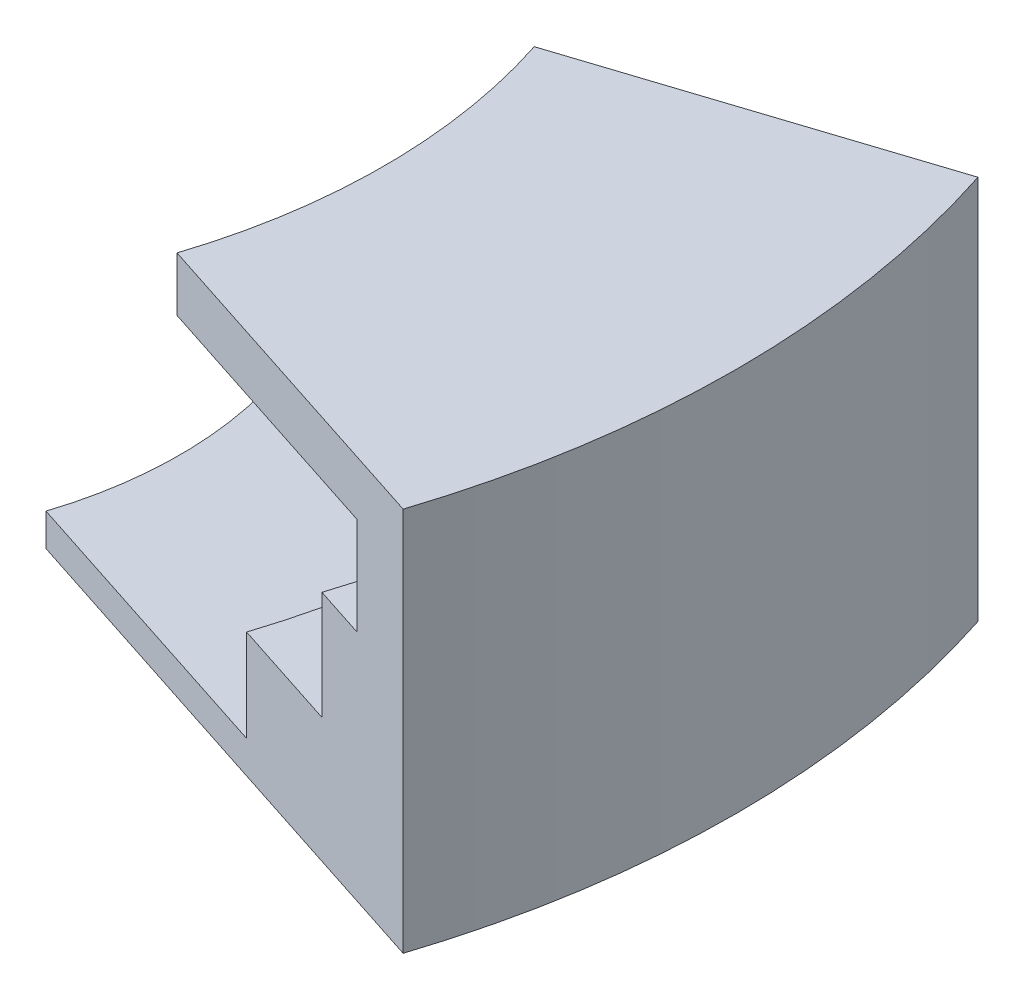
ISO-10303-21;
HEADER;
FILE_DESCRIPTION(('STEP AP214'),'2;1');
FILE_NAME('part.step','',(''),(''),'','','');
FILE_SCHEMA(('AUTOMOTIVE_DESIGN { 1 0 10303 214 1 1 1 1 }'));
ENDSEC;
DATA;
#1=APPLICATION_CONTEXT('core data for automotive mechanical design processes');
#2=APPLICATION_PROTOCOL_DEFINITION('international standard','automotive_design',2000,#1);
#3=PRODUCT_CONTEXT('',#1,'mechanical');
#4=PRODUCT('Part','Part','',(#3));
#5=PRODUCT_RELATED_PRODUCT_CATEGORY('part','',(#4));
#6=PRODUCT_DEFINITION_FORMATION('','',#4);
#7=PRODUCT_DEFINITION_CONTEXT('part definition',#1,'design');
#8=PRODUCT_DEFINITION('design','',#6,#7);
#9=PRODUCT_DEFINITION_SHAPE('','',#8);
#10=(LENGTH_UNIT() NAMED_UNIT(*) SI_UNIT(.MILLI.,.METRE.));
#11=(NAMED_UNIT(*) PLANE_ANGLE_UNIT() SI_UNIT($,.RADIAN.));
#12=(NAMED_UNIT(*) SI_UNIT($,.STERADIAN.) SOLID_ANGLE_UNIT());
#13=UNCERTAINTY_MEASURE_WITH_UNIT(LENGTH_MEASURE(1.E-05),#10,'distance_accuracy_value','');
#14=(GEOMETRIC_REPRESENTATION_CONTEXT(3) GLOBAL_UNCERTAINTY_ASSIGNED_CONTEXT((#13)) GLOBAL_UNIT_ASSIGNED_CONTEXT((#10,
#11,#12)) REPRESENTATION_CONTEXT('',''));
#15=CARTESIAN_POINT('',(0.,0.,0.));
#16=DIRECTION('',(0.,0.,1.));
#17=DIRECTION('',(1.,0.,0.));
#18=AXIS2_PLACEMENT_3D('',#15,#16,#17);
#19=CARTESIAN_POINT('',(3.54127130134828E-12,-1000.,0.));
#20=DIRECTION('',(0.,-1.,0.));
#21=DIRECTION('',(1.,0.,0.));
#22=AXIS2_PLACEMENT_3D('',#19,#20,#21);
#23=CYLINDRICAL_SURFACE('',#22,10.3500000000002);
#24=CARTESIAN_POINT('',(-2.75016451347443E-13,112.539571889782,0.));
#25=DIRECTION('',(0.,-1.,0.));
#26=DIRECTION('',(1.,0.,0.));
#27=AXIS2_PLACEMENT_3D('',#24,#25,#26);
#28=CIRCLE('',#27,10.3500000000002);
#29=CARTESIAN_POINT('',(9.84343494365476,112.539571889782,-3.19832589178074));
#30=VERTEX_POINT('',#29);
#31=CARTESIAN_POINT('',(9.84343494365474,112.539571889782,3.19832589178081));
#32=VERTEX_POINT('',#31);
#33=EDGE_CURVE('E11',#30,#32,#28,.T.);
#34=ORIENTED_EDGE('',*,*,#33,.F.);
#35=DIRECTION('',(0.,-1.,0.));
#36=VECTOR('',#35,1.);
#37=CARTESIAN_POINT('',(9.84343494365476,111.639571889782,-3.19832589178074));
#38=LINE('',#37,#36);
#39=CARTESIAN_POINT('',(9.84343494365476,111.639571889782,-3.19832589178074));
#40=VERTEX_POINT('',#39);
#41=EDGE_CURVE('E129',#30,#40,#38,.T.);
#42=ORIENTED_EDGE('',*,*,#41,.T.);
#43=CARTESIAN_POINT('',(-2.71929227248447E-13,111.639571889782,0.));
#44=DIRECTION('',(0.,-1.,0.));
#45=DIRECTION('',(1.,0.,0.));
#46=AXIS2_PLACEMENT_3D('',#43,#44,#45);
#47=CIRCLE('',#46,10.3500000000002);
#48=CARTESIAN_POINT('',(9.84343494365474,111.639571889782,3.19832589178081));
#49=VERTEX_POINT('',#48);
#50=EDGE_CURVE('E124',#40,#49,#47,.T.);
#51=ORIENTED_EDGE('',*,*,#50,.T.);
#52=DIRECTION('',(0.,-1.,0.));
#53=VECTOR('',#52,1.);
#54=CARTESIAN_POINT('',(9.84343494365474,111.639571889782,3.19832589178081));
#55=LINE('',#54,#53);
#56=EDGE_CURVE('E127',#32,#49,#55,.T.);
#57=ORIENTED_EDGE('',*,*,#56,.F.);
#58=EDGE_LOOP('',(#34,#42,#51,#57));
#59=FACE_BOUND('',#58,.T.);
#60=ADVANCED_FACE('F39',(#59),#23,.F.);
#61=CARTESIAN_POINT('',(9.84343494365476,112.539571889782,-3.19832589178074));
#62=DIRECTION('',(0.,1.,0.));
#63=DIRECTION('',(-1.,0.,0.));
#64=AXIS2_PLACEMENT_3D('',#61,#62,#63);
#65=PLANE('',#64);
#66=CARTESIAN_POINT('',(-2.75016451347443E-13,112.539571889782,0.));
#67=DIRECTION('',(0.,-1.,0.));
#68=DIRECTION('',(1.,0.,0.));
#69=AXIS2_PLACEMENT_3D('',#66,#67,#68);
#70=CIRCLE('',#69,19.0000000000002);
#71=CARTESIAN_POINT('',(18.0700738096078,112.539571889782,-5.87132289312405));
#72=VERTEX_POINT('',#71);
#73=CARTESIAN_POINT('',(18.0700738096078,112.539571889782,5.87132289312411));
#74=VERTEX_POINT('',#73);
#75=EDGE_CURVE('E48',#72,#74,#70,.T.);
#76=ORIENTED_EDGE('',*,*,#75,.F.);
#77=DIRECTION('',(-0.951056516295154,0.,0.309016994374948));
#78=VECTOR('',#77,1.);
#79=CARTESIAN_POINT('',(9.84343494365476,112.539571889782,-3.19832589178074));
#80=LINE('',#79,#78);
#81=EDGE_CURVE('E135',#72,#30,#80,.T.);
#82=ORIENTED_EDGE('',*,*,#81,.T.);
#83=ORIENTED_EDGE('',*,*,#33,.T.);
#84=DIRECTION('',(-0.951056516295154,0.,-0.309016994374948));
#85=VECTOR('',#84,1.);
#86=CARTESIAN_POINT('',(9.84343494365474,112.539571889782,3.19832589178081));
#87=LINE('',#86,#85);
#88=EDGE_CURVE('E149',#74,#32,#87,.T.);
#89=ORIENTED_EDGE('',*,*,#88,.F.);
#90=EDGE_LOOP('',(#76,#82,#83,#89));
#91=FACE_BOUND('',#90,.T.);
#92=ADVANCED_FACE('F41',(#91),#65,.T.);
#93=CARTESIAN_POINT('',(3.54127130134828E-12,-1000.,0.));
#94=DIRECTION('',(0.,-1.,0.));
#95=DIRECTION('',(1.,0.,0.));
#96=AXIS2_PLACEMENT_3D('',#93,#94,#95);
#97=CYLINDRICAL_SURFACE('',#96,19.0000000000002);
#98=CARTESIAN_POINT('',(-2.83763586294603E-13,115.089571889782,0.));
#99=DIRECTION('',(0.,-1.,0.));
#100=DIRECTION('',(1.,0.,0.));
#101=AXIS2_PLACEMENT_3D('',#98,#99,#100);
#102=CIRCLE('',#101,19.0000000000002);
#103=CARTESIAN_POINT('',(18.0700738096078,115.089571889783,-5.87132289312405));
#104=VERTEX_POINT('',#103);
#105=CARTESIAN_POINT('',(18.0700738096078,115.089571889783,5.87132289312411));
#106=VERTEX_POINT('',#105);
#107=EDGE_CURVE('E253',#104,#106,#102,.T.);
#108=ORIENTED_EDGE('',*,*,#107,.F.);
#109=DIRECTION('',(0.,-1.,0.));
#110=VECTOR('',#109,1.);
#111=CARTESIAN_POINT('',(18.0700738096078,115.089571889783,-5.87132289312405));
#112=LINE('',#111,#110);
#113=EDGE_CURVE('E225',#104,#72,#112,.T.);
#114=ORIENTED_EDGE('',*,*,#113,.T.);
#115=ORIENTED_EDGE('',*,*,#75,.T.);
#116=DIRECTION('',(0.,-1.,0.));
#117=VECTOR('',#116,1.);
#118=CARTESIAN_POINT('',(18.0700738096078,115.089571889783,5.87132289312411));
#119=LINE('',#118,#117);
#120=EDGE_CURVE('E183',#106,#74,#119,.T.);
#121=ORIENTED_EDGE('',*,*,#120,.F.);
#122=EDGE_LOOP('',(#108,#114,#115,#121));
#123=FACE_BOUND('',#122,.T.);
#124=ADVANCED_FACE('F258',(#123),#97,.F.);
#125=CARTESIAN_POINT('',(21.1610074875672,115.089571889783,-6.87562812484266));
#126=DIRECTION('',(0.,1.,0.));
#127=DIRECTION('',(-1.,0.,0.));
#128=AXIS2_PLACEMENT_3D('',#125,#126,#127);
#129=PLANE('',#128);
#130=CARTESIAN_POINT('',(-2.83763586294603E-13,115.089571889782,0.));
#131=DIRECTION('',(0.,-1.,0.));
#132=DIRECTION('',(1.,0.,0.));
#133=AXIS2_PLACEMENT_3D('',#130,#131,#132);
#134=CIRCLE('',#133,22.2500000000003);
#135=CARTESIAN_POINT('',(21.1610074875672,115.089571889783,-6.87562812484266));
#136=VERTEX_POINT('',#135);
#137=CARTESIAN_POINT('',(21.1610074875672,115.089571889783,6.87562812484273));
#138=VERTEX_POINT('',#137);
#139=EDGE_CURVE('E250',#136,#138,#134,.T.);
#140=ORIENTED_EDGE('',*,*,#139,.F.);
#141=DIRECTION('',(-0.951056516295154,0.,0.309016994374948));
#142=VECTOR('',#141,1.);
#143=CARTESIAN_POINT('',(21.1610074875672,115.089571889783,-6.87562812484266));
#144=LINE('',#143,#142);
#145=EDGE_CURVE('E221',#136,#104,#144,.T.);
#146=ORIENTED_EDGE('',*,*,#145,.T.);
#147=ORIENTED_EDGE('',*,*,#107,.T.);
#148=DIRECTION('',(-0.951056516295154,0.,-0.309016994374948));
#149=VECTOR('',#148,1.);
#150=CARTESIAN_POINT('',(21.1610074875672,115.089571889783,6.87562812484273));
#151=LINE('',#150,#149);
#152=EDGE_CURVE('E179',#138,#106,#151,.T.);
#153=ORIENTED_EDGE('',*,*,#152,.F.);
#154=EDGE_LOOP('',(#140,#146,#147,#153));
#155=FACE_BOUND('',#154,.T.);
#156=ADVANCED_FACE('F293',(#155),#129,.T.);
#157=CARTESIAN_POINT('',(3.54127130134828E-12,-1000.,0.));
#158=DIRECTION('',(0.,-1.,0.));
#159=DIRECTION('',(1.,0.,0.));
#160=AXIS2_PLACEMENT_3D('',#157,#158,#159);
#161=CYLINDRICAL_SURFACE('',#160,22.2500000000003);
#162=CARTESIAN_POINT('',(-2.9405433329126E-13,118.089571889783,0.));
#163=DIRECTION('',(0.,-1.,0.));
#164=DIRECTION('',(1.,0.,0.));
#165=AXIS2_PLACEMENT_3D('',#162,#163,#164);
#166=CIRCLE('',#165,22.2500000000003);
#167=CARTESIAN_POINT('',(21.1610074875672,118.089571889783,-6.87562812484266));
#168=VERTEX_POINT('',#167);
#169=CARTESIAN_POINT('',(21.1610074875672,118.089571889783,6.87562812484273));
#170=VERTEX_POINT('',#169);
#171=EDGE_CURVE('E247',#168,#170,#166,.T.);
#172=ORIENTED_EDGE('',*,*,#171,.F.);
#173=DIRECTION('',(0.,-1.,0.));
#174=VECTOR('',#173,1.);
#175=CARTESIAN_POINT('',(21.1610074875672,118.089571889783,-6.87562812484266));
#176=LINE('',#175,#174);
#177=EDGE_CURVE('E217',#168,#136,#176,.T.);
#178=ORIENTED_EDGE('',*,*,#177,.T.);
#179=ORIENTED_EDGE('',*,*,#139,.T.);
#180=DIRECTION('',(0.,-1.,0.));
#181=VECTOR('',#180,1.);
#182=CARTESIAN_POINT('',(21.1610074875672,118.089571889783,6.87562812484273));
#183=LINE('',#182,#181);
#184=EDGE_CURVE('E175',#170,#138,#183,.T.);
#185=ORIENTED_EDGE('',*,*,#184,.F.);
#186=EDGE_LOOP('',(#172,#178,#179,#185));
#187=FACE_BOUND('',#186,.T.);
#188=ADVANCED_FACE('F290',(#187),#161,.F.);
#189=CARTESIAN_POINT('',(22.5875922620099,118.089571889783,-7.33915361640509));
#190=DIRECTION('',(0.,1.,0.));
#191=DIRECTION('',(-1.,0.,0.));
#192=AXIS2_PLACEMENT_3D('',#189,#190,#191);
#193=PLANE('',#192);
#194=CARTESIAN_POINT('',(-2.9405433329126E-13,118.089571889783,0.));
#195=DIRECTION('',(0.,-1.,0.));
#196=DIRECTION('',(1.,0.,0.));
#197=AXIS2_PLACEMENT_3D('',#194,#195,#196);
#198=CIRCLE('',#197,23.7500000000003);
#199=CARTESIAN_POINT('',(22.5875922620099,118.089571889783,-7.33915361640509));
#200=VERTEX_POINT('',#199);
#201=CARTESIAN_POINT('',(22.5875922620099,118.089571889783,7.33915361640515));
#202=VERTEX_POINT('',#201);
#203=EDGE_CURVE('E244',#200,#202,#198,.T.);
#204=ORIENTED_EDGE('',*,*,#203,.F.);
#205=DIRECTION('',(-0.951056516295154,0.,0.309016994374948));
#206=VECTOR('',#205,1.);
#207=CARTESIAN_POINT('',(22.5875922620099,118.089571889783,-7.33915361640509));
#208=LINE('',#207,#206);
#209=EDGE_CURVE('E213',#200,#168,#208,.T.);
#210=ORIENTED_EDGE('',*,*,#209,.T.);
#211=ORIENTED_EDGE('',*,*,#171,.T.);
#212=DIRECTION('',(-0.951056516295154,0.,-0.309016994374948));
#213=VECTOR('',#212,1.);
#214=CARTESIAN_POINT('',(22.5875922620099,118.089571889783,7.33915361640515));
#215=LINE('',#214,#213);
#216=EDGE_CURVE('E171',#202,#170,#215,.T.);
#217=ORIENTED_EDGE('',*,*,#216,.F.);
#218=EDGE_LOOP('',(#204,#210,#211,#217));
#219=FACE_BOUND('',#218,.T.);
#220=ADVANCED_FACE('F287',(#219),#193,.T.);
#221=CARTESIAN_POINT('',(3.54127130134828E-12,-1000.,0.));
#222=DIRECTION('',(0.,-1.,0.));
#223=DIRECTION('',(1.,0.,0.));
#224=AXIS2_PLACEMENT_3D('',#221,#222,#223);
#225=CYLINDRICAL_SURFACE('',#224,23.7500000000003);
#226=CARTESIAN_POINT('',(-3.03316005588252E-13,120.789571889782,0.));
#227=DIRECTION('',(0.,-1.,0.));
#228=DIRECTION('',(1.,0.,0.));
#229=AXIS2_PLACEMENT_3D('',#226,#227,#228);
#230=CIRCLE('',#229,23.7500000000003);
#231=CARTESIAN_POINT('',(22.5875922620099,120.789571889782,-7.33915361640509));
#232=VERTEX_POINT('',#231);
#233=CARTESIAN_POINT('',(22.5875922620099,120.789571889782,7.33915361640516));
#234=VERTEX_POINT('',#233);
#235=EDGE_CURVE('E241',#232,#234,#230,.T.);
#236=ORIENTED_EDGE('',*,*,#235,.F.);
#237=DIRECTION('',(0.,-1.,0.));
#238=VECTOR('',#237,1.);
#239=CARTESIAN_POINT('',(22.5875922620099,118.089571889783,-7.33915361640509));
#240=LINE('',#239,#238);
#241=EDGE_CURVE('E209',#232,#200,#240,.T.);
#242=ORIENTED_EDGE('',*,*,#241,.T.);
#243=ORIENTED_EDGE('',*,*,#203,.T.);
#244=DIRECTION('',(0.,-1.,0.));
#245=VECTOR('',#244,1.);
#246=CARTESIAN_POINT('',(22.5875922620099,118.089571889783,7.33915361640515));
#247=LINE('',#246,#245);
#248=EDGE_CURVE('E167',#234,#202,#247,.T.);
#249=ORIENTED_EDGE('',*,*,#248,.F.);
#250=EDGE_LOOP('',(#236,#242,#243,#249));
#251=FACE_BOUND('',#250,.T.);
#252=ADVANCED_FACE('F282',(#251),#225,.F.);
#253=CARTESIAN_POINT('',(22.5875922620099,120.789571889783,-7.33915361640509));
#254=DIRECTION('',(0.,-1.,0.));
#255=DIRECTION('',(1.,0.,0.));
#256=AXIS2_PLACEMENT_3D('',#253,#254,#255);
#257=PLANE('',#256);
#258=CARTESIAN_POINT('',(-3.03316005588252E-13,120.789571889782,0.));
#259=DIRECTION('',(0.,-1.,0.));
#260=DIRECTION('',(1.,0.,0.));
#261=AXIS2_PLACEMENT_3D('',#258,#259,#260);
#262=CIRCLE('',#261,16.0000000000003);
#263=CARTESIAN_POINT('',(15.2169042607224,120.789571889782,-4.94427190999922));
#264=VERTEX_POINT('',#263);
#265=CARTESIAN_POINT('',(15.2169042607224,120.789571889782,4.94427190999929));
#266=VERTEX_POINT('',#265);
#267=EDGE_CURVE('E238',#264,#266,#262,.T.);
#268=ORIENTED_EDGE('',*,*,#267,.F.);
#269=DIRECTION('',(0.951056516295154,0.,-0.309016994374948));
#270=VECTOR('',#269,1.);
#271=CARTESIAN_POINT('',(22.5875922620099,120.789571889782,-7.33915361640509));
#272=LINE('',#271,#270);
#273=EDGE_CURVE('E205',#264,#232,#272,.T.);
#274=ORIENTED_EDGE('',*,*,#273,.T.);
#275=ORIENTED_EDGE('',*,*,#235,.T.);
#276=DIRECTION('',(0.951056516295154,0.,0.309016994374948));
#277=VECTOR('',#276,1.);
#278=CARTESIAN_POINT('',(22.5875922620099,120.789571889782,7.33915361640516));
#279=LINE('',#278,#277);
#280=EDGE_CURVE('E163',#266,#234,#279,.T.);
#281=ORIENTED_EDGE('',*,*,#280,.F.);
#282=EDGE_LOOP('',(#268,#274,#275,#281));
#283=FACE_BOUND('',#282,.T.);
#284=ADVANCED_FACE('F279',(#283),#257,.T.);
#285=CARTESIAN_POINT('',(3.54127130134828E-12,-1000.,0.));
#286=DIRECTION('',(0.,-1.,0.));
#287=DIRECTION('',(1.,0.,0.));
#288=AXIS2_PLACEMENT_3D('',#285,#286,#287);
#289=CYLINDRICAL_SURFACE('',#288,16.0000000000003);
#290=CARTESIAN_POINT('',(-3.0846137908658E-13,122.289571889783,0.));
#291=DIRECTION('',(0.,-1.,0.));
#292=DIRECTION('',(1.,0.,0.));
#293=AXIS2_PLACEMENT_3D('',#290,#291,#292);
#294=CIRCLE('',#293,16.0000000000003);
#295=CARTESIAN_POINT('',(15.2169042607224,122.289571889782,-4.94427190999923));
#296=VERTEX_POINT('',#295);
#297=CARTESIAN_POINT('',(15.2169042607224,122.289571889782,4.94427190999929));
#298=VERTEX_POINT('',#297);
#299=EDGE_CURVE('E235',#296,#298,#294,.T.);
#300=ORIENTED_EDGE('',*,*,#299,.F.);
#301=DIRECTION('',(0.,-1.,0.));
#302=VECTOR('',#301,1.);
#303=CARTESIAN_POINT('',(15.2169042607224,120.789571889782,-4.94427190999922));
#304=LINE('',#303,#302);
#305=EDGE_CURVE('E201',#296,#264,#304,.T.);
#306=ORIENTED_EDGE('',*,*,#305,.T.);
#307=ORIENTED_EDGE('',*,*,#267,.T.);
#308=DIRECTION('',(0.,-1.,0.));
#309=VECTOR('',#308,1.);
#310=CARTESIAN_POINT('',(15.2169042607224,120.789571889782,4.94427190999929));
#311=LINE('',#310,#309);
#312=EDGE_CURVE('E159',#298,#266,#311,.T.);
#313=ORIENTED_EDGE('',*,*,#312,.F.);
#314=EDGE_LOOP('',(#300,#306,#307,#313));
#315=FACE_BOUND('',#314,.T.);
#316=ADVANCED_FACE('F274',(#315),#289,.F.);
#317=CARTESIAN_POINT('',(15.2169042607224,122.289571889782,-4.94427190999923));
#318=DIRECTION('',(0.,1.,0.));
#319=DIRECTION('',(-1.,0.,0.));
#320=AXIS2_PLACEMENT_3D('',#317,#318,#319);
#321=PLANE('',#320);
#322=CARTESIAN_POINT('',(-3.0846137908658E-13,122.289571889783,0.));
#323=DIRECTION('',(0.,-1.,0.));
#324=DIRECTION('',(1.,0.,0.));
#325=AXIS2_PLACEMENT_3D('',#322,#323,#324);
#326=CIRCLE('',#325,25.7500000000003);
#327=CARTESIAN_POINT('',(24.4897052946002,122.289571889782,-7.95718760515498));
#328=VERTEX_POINT('',#327);
#329=CARTESIAN_POINT('',(24.4897052946002,122.289571889782,7.95718760515506));
#330=VERTEX_POINT('',#329);
#331=EDGE_CURVE('E232',#328,#330,#326,.T.);
#332=ORIENTED_EDGE('',*,*,#331,.F.);
#333=DIRECTION('',(-0.951056516295153,0.,0.309016994374948));
#334=VECTOR('',#333,1.);
#335=CARTESIAN_POINT('',(15.2169042607224,122.289571889782,-4.94427190999923));
#336=LINE('',#335,#334);
#337=EDGE_CURVE('E197',#328,#296,#336,.T.);
#338=ORIENTED_EDGE('',*,*,#337,.T.);
#339=ORIENTED_EDGE('',*,*,#299,.T.);
#340=DIRECTION('',(-0.951056516295153,0.,-0.309016994374948));
#341=VECTOR('',#340,1.);
#342=CARTESIAN_POINT('',(15.2169042607224,122.289571889782,4.94427190999929));
#343=LINE('',#342,#341);
#344=EDGE_CURVE('E155',#330,#298,#343,.T.);
#345=ORIENTED_EDGE('',*,*,#344,.F.);
#346=EDGE_LOOP('',(#332,#338,#339,#345));
#347=FACE_BOUND('',#346,.T.);
#348=ADVANCED_FACE('F272',(#347),#321,.T.);
#349=CARTESIAN_POINT('',(3.54127130134828E-12,-1000.,0.));
#350=DIRECTION('',(0.,-1.,0.));
#351=DIRECTION('',(1.,0.,0.));
#352=AXIS2_PLACEMENT_3D('',#349,#350,#351);
#353=CYLINDRICAL_SURFACE('',#352,25.7500000000003);
#354=CARTESIAN_POINT('',(-2.71929227248447E-13,111.639571889782,0.));
#355=DIRECTION('',(0.,-1.,0.));
#356=DIRECTION('',(1.,0.,0.));
#357=AXIS2_PLACEMENT_3D('',#354,#355,#356);
#358=CIRCLE('',#357,25.7500000000003);
#359=CARTESIAN_POINT('',(24.4897052946002,111.639571889782,-7.95718760515498));
#360=VERTEX_POINT('',#359);
#361=CARTESIAN_POINT('',(24.4897052946002,111.639571889782,7.95718760515504));
#362=VERTEX_POINT('',#361);
#363=EDGE_CURVE('E134',#360,#362,#358,.T.);
#364=ORIENTED_EDGE('',*,*,#363,.F.);
#365=DIRECTION('',(0.,1.,0.));
#366=VECTOR('',#365,1.);
#367=CARTESIAN_POINT('',(24.4897052946002,122.289571889782,-7.95718760515498));
#368=LINE('',#367,#366);
#369=EDGE_CURVE('E193',#360,#328,#368,.T.);
#370=ORIENTED_EDGE('',*,*,#369,.T.);
#371=ORIENTED_EDGE('',*,*,#331,.T.);
#372=DIRECTION('',(0.,1.,0.));
#373=VECTOR('',#372,1.);
#374=CARTESIAN_POINT('',(24.4897052946002,122.289571889782,7.95718760515506));
#375=LINE('',#374,#373);
#376=EDGE_CURVE('E144',#362,#330,#375,.T.);
#377=ORIENTED_EDGE('',*,*,#376,.F.);
#378=EDGE_LOOP('',(#364,#370,#371,#377));
#379=FACE_BOUND('',#378,.T.);
#380=ADVANCED_FACE('F268',(#379),#353,.T.);
#381=CARTESIAN_POINT('',(24.4897052946002,111.639571889782,-7.95718760515498));
#382=DIRECTION('',(0.,-1.,0.));
#383=DIRECTION('',(1.,0.,0.));
#384=AXIS2_PLACEMENT_3D('',#381,#382,#383);
#385=PLANE('',#384);
#386=DIRECTION('',(0.951056516295153,0.,-0.309016994374948));
#387=VECTOR('',#386,1.);
#388=CARTESIAN_POINT('',(24.4897052946002,111.639571889782,-7.95718760515498));
#389=LINE('',#388,#387);
#390=EDGE_CURVE('E190',#40,#360,#389,.T.);
#391=ORIENTED_EDGE('',*,*,#390,.T.);
#392=ORIENTED_EDGE('',*,*,#363,.T.);
#393=DIRECTION('',(0.951056516295153,0.,0.309016994374948));
#394=VECTOR('',#393,1.);
#395=CARTESIAN_POINT('',(24.4897052946002,111.639571889782,7.95718760515504));
#396=LINE('',#395,#394);
#397=EDGE_CURVE('E138',#49,#362,#396,.T.);
#398=ORIENTED_EDGE('',*,*,#397,.F.);
#399=ORIENTED_EDGE('',*,*,#50,.F.);
#400=EDGE_LOOP('',(#391,#392,#398,#399));
#401=FACE_BOUND('',#400,.T.);
#402=ADVANCED_FACE('F139',(#401),#385,.T.);
#403=CARTESIAN_POINT('',(0.,0.,0.));
#404=DIRECTION('',(-0.309016994374948,0.,-0.951056516295154));
#405=DIRECTION('',(-0.951056516295154,0.,0.309016994374948));
#406=AXIS2_PLACEMENT_3D('',#403,#404,#405);
#407=PLANE('',#406);
#408=ORIENTED_EDGE('',*,*,#41,.F.);
#409=ORIENTED_EDGE('',*,*,#81,.F.);
#410=ORIENTED_EDGE('',*,*,#113,.F.);
#411=ORIENTED_EDGE('',*,*,#145,.F.);
#412=ORIENTED_EDGE('',*,*,#177,.F.);
#413=ORIENTED_EDGE('',*,*,#209,.F.);
#414=ORIENTED_EDGE('',*,*,#241,.F.);
#415=ORIENTED_EDGE('',*,*,#273,.F.);
#416=ORIENTED_EDGE('',*,*,#305,.F.);
#417=ORIENTED_EDGE('',*,*,#337,.F.);
#418=ORIENTED_EDGE('',*,*,#369,.F.);
#419=ORIENTED_EDGE('',*,*,#390,.F.);
#420=EDGE_LOOP('',(#408,#409,#410,#411,#412,#413,#414,#415,#416,#417,#418,#419));
#421=FACE_BOUND('',#420,.T.);
#422=ADVANCED_FACE('F263',(#421),#407,.T.);
#423=CARTESIAN_POINT('',(0.,0.,0.));
#424=DIRECTION('',(0.309016994374948,0.,-0.951056516295154));
#425=DIRECTION('',(-0.951056516295154,0.,-0.309016994374948));
#426=AXIS2_PLACEMENT_3D('',#423,#424,#425);
#427=PLANE('',#426);
#428=ORIENTED_EDGE('',*,*,#56,.T.);
#429=ORIENTED_EDGE('',*,*,#397,.T.);
#430=ORIENTED_EDGE('',*,*,#376,.T.);
#431=ORIENTED_EDGE('',*,*,#344,.T.);
#432=ORIENTED_EDGE('',*,*,#312,.T.);
#433=ORIENTED_EDGE('',*,*,#280,.T.);
#434=ORIENTED_EDGE('',*,*,#248,.T.);
#435=ORIENTED_EDGE('',*,*,#216,.T.);
#436=ORIENTED_EDGE('',*,*,#184,.T.);
#437=ORIENTED_EDGE('',*,*,#152,.T.);
#438=ORIENTED_EDGE('',*,*,#120,.T.);
#439=ORIENTED_EDGE('',*,*,#88,.T.);
#440=EDGE_LOOP('',(#428,#429,#430,#431,#432,#433,#434,#435,#436,#437,#438,#439));
#441=FACE_BOUND('',#440,.T.);
#442=ADVANCED_FACE('F147',(#441),#427,.F.);
#443=CLOSED_SHELL('',(#60,#92,#124,#156,#188,#220,#252,#284,#316,#348,#380,#402,#422,#442));
#444=MANIFOLD_SOLID_BREP('B2',#443);
#445=ADVANCED_BREP_SHAPE_REPRESENTATION('',(#18,#444),#14);
#446=SHAPE_DEFINITION_REPRESENTATION(#9,#445);
ENDSEC;
END-ISO-10303-21;
